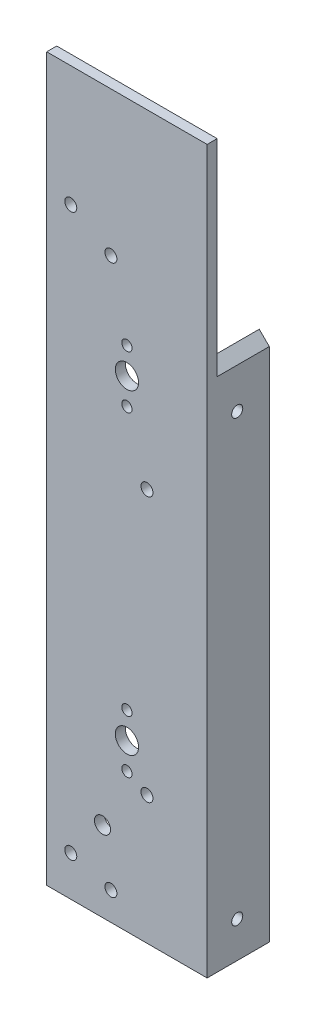
ISO-10303-21;
HEADER;
FILE_DESCRIPTION(('STEP AP214'),'2;1');
FILE_NAME('part.step','',(''),(''),'','','');
FILE_SCHEMA(('AUTOMOTIVE_DESIGN { 1 0 10303 214 1 1 1 1 }'));
ENDSEC;
DATA;
#1=APPLICATION_CONTEXT('core data for automotive mechanical design processes');
#2=APPLICATION_PROTOCOL_DEFINITION('international standard','automotive_design',2000,#1);
#3=PRODUCT_CONTEXT('',#1,'mechanical');
#4=PRODUCT('Part','Part','',(#3));
#5=PRODUCT_RELATED_PRODUCT_CATEGORY('part','',(#4));
#6=PRODUCT_DEFINITION_FORMATION('','',#4);
#7=PRODUCT_DEFINITION_CONTEXT('part definition',#1,'design');
#8=PRODUCT_DEFINITION('design','',#6,#7);
#9=PRODUCT_DEFINITION_SHAPE('','',#8);
#10=(LENGTH_UNIT() NAMED_UNIT(*) SI_UNIT(.MILLI.,.METRE.));
#11=(NAMED_UNIT(*) PLANE_ANGLE_UNIT() SI_UNIT($,.RADIAN.));
#12=(NAMED_UNIT(*) SI_UNIT($,.STERADIAN.) SOLID_ANGLE_UNIT());
#13=UNCERTAINTY_MEASURE_WITH_UNIT(LENGTH_MEASURE(1.E-05),#10,'distance_accuracy_value','');
#14=(GEOMETRIC_REPRESENTATION_CONTEXT(3) GLOBAL_UNCERTAINTY_ASSIGNED_CONTEXT((#13)) GLOBAL_UNIT_ASSIGNED_CONTEXT((#10,
#11,#12)) REPRESENTATION_CONTEXT('',''));
#15=CARTESIAN_POINT('',(0.,0.,0.));
#16=DIRECTION('',(0.,0.,1.));
#17=DIRECTION('',(1.,0.,0.));
#18=AXIS2_PLACEMENT_3D('',#15,#16,#17);
#19=CARTESIAN_POINT('',(-50.8,203.2,0.));
#20=DIRECTION('',(-1.,0.,0.));
#21=DIRECTION('',(0.,0.,1.));
#22=AXIS2_PLACEMENT_3D('',#19,#20,#21);
#23=PLANE('',#22);
#24=DIRECTION('',(0.,0.,-1.));
#25=VECTOR('',#24,1.);
#26=CARTESIAN_POINT('',(-50.8,0.,0.));
#27=LINE('',#26,#25);
#28=CARTESIAN_POINT('',(-50.8,0.,0.));
#29=VERTEX_POINT('',#28);
#30=CARTESIAN_POINT('',(-50.8,0.,-3.17499999999999));
#31=VERTEX_POINT('',#30);
#32=EDGE_CURVE('E171',#29,#31,#27,.T.);
#33=ORIENTED_EDGE('',*,*,#32,.F.);
#34=DIRECTION('',(0.,-1.,0.));
#35=VECTOR('',#34,1.);
#36=CARTESIAN_POINT('',(-50.8,203.2,0.));
#37=LINE('',#36,#35);
#38=CARTESIAN_POINT('',(-50.8,228.6,0.));
#39=VERTEX_POINT('',#38);
#40=EDGE_CURVE('E43',#39,#29,#37,.T.);
#41=ORIENTED_EDGE('',*,*,#40,.F.);
#42=DIRECTION('',(0.,0.,1.));
#43=VECTOR('',#42,1.);
#44=CARTESIAN_POINT('',(-50.8,228.6,-3.175));
#45=LINE('',#44,#43);
#46=CARTESIAN_POINT('',(-50.8,228.6,-3.175));
#47=VERTEX_POINT('',#46);
#48=EDGE_CURVE('E102',#47,#39,#45,.T.);
#49=ORIENTED_EDGE('',*,*,#48,.F.);
#50=DIRECTION('',(0.,-1.,0.));
#51=VECTOR('',#50,1.);
#52=CARTESIAN_POINT('',(-50.8,203.2,-3.17499999999999));
#53=LINE('',#52,#51);
#54=EDGE_CURVE('E113',#47,#31,#53,.T.);
#55=ORIENTED_EDGE('',*,*,#54,.T.);
#56=EDGE_LOOP('',(#33,#41,#49,#55));
#57=FACE_BOUND('',#56,.T.);
#58=ADVANCED_FACE('F35',(#57),#23,.T.);
#59=CARTESIAN_POINT('',(0.,203.2,0.));
#60=DIRECTION('',(0.,0.,1.));
#61=DIRECTION('',(1.,0.,0.));
#62=AXIS2_PLACEMENT_3D('',#59,#60,#61);
#63=PLANE('',#62);
#64=CARTESIAN_POINT('',(-25.4,60.782,0.));
#65=DIRECTION('',(0.,0.,1.));
#66=DIRECTION('',(1.,0.,0.));
#67=AXIS2_PLACEMENT_3D('',#64,#65,#66);
#68=CIRCLE('',#67,1.63195000000003);
#69=CARTESIAN_POINT('',(-23.76805,60.782,0.));
#70=VERTEX_POINT('',#69);
#71=EDGE_CURVE('E215',#70,#70,#68,.T.);
#72=ORIENTED_EDGE('',*,*,#71,.F.);
#73=EDGE_LOOP('',(#72));
#74=FACE_BOUND('',#73,.T.);
#75=CARTESIAN_POINT('',(-25.4,44.018,0.));
#76=DIRECTION('',(0.,0.,1.));
#77=DIRECTION('',(1.,0.,0.));
#78=AXIS2_PLACEMENT_3D('',#75,#76,#77);
#79=CIRCLE('',#78,1.63195000000003);
#80=CARTESIAN_POINT('',(-23.76805,44.018,0.));
#81=VERTEX_POINT('',#80);
#82=EDGE_CURVE('E218',#81,#81,#79,.T.);
#83=ORIENTED_EDGE('',*,*,#82,.F.);
#84=EDGE_LOOP('',(#83));
#85=FACE_BOUND('',#84,.T.);
#86=CARTESIAN_POINT('',(-25.4,52.4,0.));
#87=DIRECTION('',(0.,0.,1.));
#88=DIRECTION('',(1.,0.,0.));
#89=AXIS2_PLACEMENT_3D('',#86,#87,#88);
#90=CIRCLE('',#89,3.68299999999999);
#91=CARTESIAN_POINT('',(-21.717,52.4,0.));
#92=VERTEX_POINT('',#91);
#93=EDGE_CURVE('E214',#92,#92,#90,.T.);
#94=ORIENTED_EDGE('',*,*,#93,.F.);
#95=EDGE_LOOP('',(#94));
#96=FACE_BOUND('',#95,.T.);
#97=CARTESIAN_POINT('',(-43.18,190.498941663727,0.));
#98=DIRECTION('',(0.,0.,-1.));
#99=DIRECTION('',(-1.,0.,0.));
#100=AXIS2_PLACEMENT_3D('',#97,#98,#99);
#101=CIRCLE('',#100,1.89865);
#102=CARTESIAN_POINT('',(-45.07865,190.498941663727,0.));
#103=VERTEX_POINT('',#102);
#104=EDGE_CURVE('E232',#103,#103,#101,.T.);
#105=ORIENTED_EDGE('',*,*,#104,.T.);
#106=EDGE_LOOP('',(#105));
#107=FACE_BOUND('',#106,.T.);
#108=CARTESIAN_POINT('',(-43.18,12.7,0.));
#109=DIRECTION('',(0.,0.,-1.));
#110=DIRECTION('',(-1.,0.,0.));
#111=AXIS2_PLACEMENT_3D('',#108,#109,#110);
#112=CIRCLE('',#111,1.89865);
#113=CARTESIAN_POINT('',(-45.07865,12.7,0.));
#114=VERTEX_POINT('',#113);
#115=EDGE_CURVE('E238',#114,#114,#112,.T.);
#116=ORIENTED_EDGE('',*,*,#115,.T.);
#117=EDGE_LOOP('',(#116));
#118=FACE_BOUND('',#117,.T.);
#119=CARTESIAN_POINT('',(-33.1361964987955,25.4,0.));
#120=DIRECTION('',(0.,0.,1.));
#121=DIRECTION('',(1.,0.,0.));
#122=AXIS2_PLACEMENT_3D('',#119,#120,#121);
#123=CIRCLE('',#122,2.54);
#124=CARTESIAN_POINT('',(-30.5961964987955,25.4,0.));
#125=VERTEX_POINT('',#124);
#126=EDGE_CURVE('E211',#125,#125,#123,.T.);
#127=ORIENTED_EDGE('',*,*,#126,.F.);
#128=EDGE_LOOP('',(#127));
#129=FACE_BOUND('',#128,.T.);
#130=DIRECTION('',(-1.,0.,0.));
#131=VECTOR('',#130,1.);
#132=CARTESIAN_POINT('',(-50.8,228.6,0.));
#133=LINE('',#132,#131);
#134=CARTESIAN_POINT('',(0.,228.6,0.));
#135=VERTEX_POINT('',#134);
#136=EDGE_CURVE('E100',#135,#39,#133,.T.);
#137=ORIENTED_EDGE('',*,*,#136,.T.);
#138=ORIENTED_EDGE('',*,*,#40,.T.);
#139=DIRECTION('',(-1.,0.,0.));
#140=VECTOR('',#139,1.);
#141=CARTESIAN_POINT('',(0.,0.,0.));
#142=LINE('',#141,#140);
#143=CARTESIAN_POINT('',(0.,0.,0.));
#144=VERTEX_POINT('',#143);
#145=EDGE_CURVE('E186',#144,#29,#142,.T.);
#146=ORIENTED_EDGE('',*,*,#145,.F.);
#147=DIRECTION('',(0.,-1.,0.));
#148=VECTOR('',#147,1.);
#149=CARTESIAN_POINT('',(0.,203.2,0.));
#150=LINE('',#149,#148);
#151=EDGE_CURVE('E190',#135,#144,#150,.T.);
#152=ORIENTED_EDGE('',*,*,#151,.F.);
#153=EDGE_LOOP('',(#137,#138,#146,#152));
#154=FACE_BOUND('',#153,.T.);
#155=CARTESIAN_POINT('',(-19.05,124.46,0.));
#156=DIRECTION('',(0.,0.,-1.));
#157=DIRECTION('',(-1.,0.,0.));
#158=AXIS2_PLACEMENT_3D('',#155,#156,#157);
#159=CIRCLE('',#158,1.89865);
#160=CARTESIAN_POINT('',(-20.94865,124.46,0.));
#161=VERTEX_POINT('',#160);
#162=EDGE_CURVE('E122',#161,#161,#159,.T.);
#163=ORIENTED_EDGE('',*,*,#162,.T.);
#164=EDGE_LOOP('',(#163));
#165=FACE_BOUND('',#164,.T.);
#166=CARTESIAN_POINT('',(-19.05,40.64,0.));
#167=DIRECTION('',(0.,0.,-1.));
#168=DIRECTION('',(-1.,0.,0.));
#169=AXIS2_PLACEMENT_3D('',#166,#167,#168);
#170=CIRCLE('',#169,1.89865);
#171=CARTESIAN_POINT('',(-20.94865,40.64,0.));
#172=VERTEX_POINT('',#171);
#173=EDGE_CURVE('E128',#172,#172,#170,.T.);
#174=ORIENTED_EDGE('',*,*,#173,.T.);
#175=EDGE_LOOP('',(#174));
#176=FACE_BOUND('',#175,.T.);
#177=CARTESIAN_POINT('',(-30.4799999999999,182.88,0.));
#178=DIRECTION('',(0.,0.,-1.));
#179=DIRECTION('',(-1.,0.,0.));
#180=AXIS2_PLACEMENT_3D('',#177,#178,#179);
#181=CIRCLE('',#180,1.89865);
#182=CARTESIAN_POINT('',(-32.3786499999999,182.88,0.));
#183=VERTEX_POINT('',#182);
#184=EDGE_CURVE('E134',#183,#183,#181,.T.);
#185=ORIENTED_EDGE('',*,*,#184,.T.);
#186=EDGE_LOOP('',(#185));
#187=FACE_BOUND('',#186,.T.);
#188=CARTESIAN_POINT('',(-30.48,8.89,0.));
#189=DIRECTION('',(0.,0.,-1.));
#190=DIRECTION('',(-1.,0.,0.));
#191=AXIS2_PLACEMENT_3D('',#188,#189,#190);
#192=CIRCLE('',#191,1.89865);
#193=CARTESIAN_POINT('',(-32.37865,8.89,0.));
#194=VERTEX_POINT('',#193);
#195=EDGE_CURVE('E140',#194,#194,#192,.T.);
#196=ORIENTED_EDGE('',*,*,#195,.T.);
#197=EDGE_LOOP('',(#196));
#198=FACE_BOUND('',#197,.T.);
#199=CARTESIAN_POINT('',(-25.4,144.018,0.));
#200=DIRECTION('',(0.,0.,1.));
#201=DIRECTION('',(1.,0.,0.));
#202=AXIS2_PLACEMENT_3D('',#199,#200,#201);
#203=CIRCLE('',#202,1.63195000000002);
#204=CARTESIAN_POINT('',(-23.76805,144.018,0.));
#205=VERTEX_POINT('',#204);
#206=EDGE_CURVE('E153',#205,#205,#203,.T.);
#207=ORIENTED_EDGE('',*,*,#206,.F.);
#208=EDGE_LOOP('',(#207));
#209=FACE_BOUND('',#208,.T.);
#210=CARTESIAN_POINT('',(-25.4,160.782,0.));
#211=DIRECTION('',(0.,0.,1.));
#212=DIRECTION('',(1.,0.,0.));
#213=AXIS2_PLACEMENT_3D('',#210,#211,#212);
#214=CIRCLE('',#213,1.63195000000002);
#215=CARTESIAN_POINT('',(-23.76805,160.782,0.));
#216=VERTEX_POINT('',#215);
#217=EDGE_CURVE('E157',#216,#216,#214,.T.);
#218=ORIENTED_EDGE('',*,*,#217,.F.);
#219=EDGE_LOOP('',(#218));
#220=FACE_BOUND('',#219,.T.);
#221=CARTESIAN_POINT('',(-25.4,152.4,0.));
#222=DIRECTION('',(0.,0.,1.));
#223=DIRECTION('',(1.,0.,0.));
#224=AXIS2_PLACEMENT_3D('',#221,#222,#223);
#225=CIRCLE('',#224,3.68299999999999);
#226=CARTESIAN_POINT('',(-21.717,152.4,0.));
#227=VERTEX_POINT('',#226);
#228=EDGE_CURVE('E161',#227,#227,#225,.T.);
#229=ORIENTED_EDGE('',*,*,#228,.F.);
#230=EDGE_LOOP('',(#229));
#231=FACE_BOUND('',#230,.T.);
#232=ADVANCED_FACE('F247',(#74,#85,#96,#107,#118,#129,#154,#165,#176,#187,#198,#209,#220,#231),
#63,.T.);
#233=CARTESIAN_POINT('',(0.,203.2,-19.685));
#234=DIRECTION('',(1.,0.,0.));
#235=DIRECTION('',(0.,0.,-1.));
#236=AXIS2_PLACEMENT_3D('',#233,#234,#235);
#237=PLANE('',#236);
#238=CARTESIAN_POINT('',(0.,11.43,-9.53047451334044));
#239=DIRECTION('',(1.,0.,0.));
#240=DIRECTION('',(0.,0.,-1.));
#241=AXIS2_PLACEMENT_3D('',#238,#239,#240);
#242=CIRCLE('',#241,1.7526);
#243=CARTESIAN_POINT('',(0.,11.43,-11.2830745133404));
#244=VERTEX_POINT('',#243);
#245=EDGE_CURVE('E143',#244,#244,#242,.T.);
#246=ORIENTED_EDGE('',*,*,#245,.F.);
#247=EDGE_LOOP('',(#246));
#248=FACE_BOUND('',#247,.T.);
#249=CARTESIAN_POINT('',(0.,150.622,-9.53047451334044));
#250=DIRECTION('',(1.,0.,0.));
#251=DIRECTION('',(0.,0.,-1.));
#252=AXIS2_PLACEMENT_3D('',#249,#250,#251);
#253=CIRCLE('',#252,1.7526);
#254=CARTESIAN_POINT('',(0.,150.622,-11.2830745133404));
#255=VERTEX_POINT('',#254);
#256=EDGE_CURVE('E149',#255,#255,#253,.T.);
#257=ORIENTED_EDGE('',*,*,#256,.F.);
#258=EDGE_LOOP('',(#257));
#259=FACE_BOUND('',#258,.T.);
#260=DIRECTION('',(0.,0.,1.));
#261=VECTOR('',#260,1.);
#262=CARTESIAN_POINT('',(0.,163.322,-19.685));
#263=LINE('',#262,#261);
#264=CARTESIAN_POINT('',(0.,163.322,-19.685));
#265=VERTEX_POINT('',#264);
#266=CARTESIAN_POINT('',(0.,163.322,-3.175));
#267=VERTEX_POINT('',#266);
#268=EDGE_CURVE('E108',#265,#267,#263,.T.);
#269=ORIENTED_EDGE('',*,*,#268,.T.);
#270=DIRECTION('',(0.,1.,0.));
#271=VECTOR('',#270,1.);
#272=CARTESIAN_POINT('',(0.,228.6,-3.175));
#273=LINE('',#272,#271);
#274=CARTESIAN_POINT('',(0.,228.6,-3.175));
#275=VERTEX_POINT('',#274);
#276=EDGE_CURVE('E105',#267,#275,#273,.T.);
#277=ORIENTED_EDGE('',*,*,#276,.T.);
#278=DIRECTION('',(0.,0.,1.));
#279=VECTOR('',#278,1.);
#280=CARTESIAN_POINT('',(0.,228.6,-3.175));
#281=LINE('',#280,#279);
#282=EDGE_CURVE('E94',#275,#135,#281,.T.);
#283=ORIENTED_EDGE('',*,*,#282,.T.);
#284=ORIENTED_EDGE('',*,*,#151,.T.);
#285=DIRECTION('',(0.,0.,1.));
#286=VECTOR('',#285,1.);
#287=CARTESIAN_POINT('',(0.,0.,-19.685));
#288=LINE('',#287,#286);
#289=CARTESIAN_POINT('',(0.,0.,-19.685));
#290=VERTEX_POINT('',#289);
#291=EDGE_CURVE('E183',#290,#144,#288,.T.);
#292=ORIENTED_EDGE('',*,*,#291,.F.);
#293=DIRECTION('',(0.,-1.,0.));
#294=VECTOR('',#293,1.);
#295=CARTESIAN_POINT('',(0.,203.2,-19.685));
#296=LINE('',#295,#294);
#297=EDGE_CURVE('E192',#265,#290,#296,.T.);
#298=ORIENTED_EDGE('',*,*,#297,.F.);
#299=EDGE_LOOP('',(#269,#277,#283,#284,#292,#298));
#300=FACE_BOUND('',#299,.T.);
#301=ADVANCED_FACE('F106',(#248,#259,#300),#237,.T.);
#302=CARTESIAN_POINT('',(-3.17500000000001,203.2,-19.685));
#303=DIRECTION('',(0.,0.,-1.));
#304=DIRECTION('',(-1.,0.,0.));
#305=AXIS2_PLACEMENT_3D('',#302,#303,#304);
#306=PLANE('',#305);
#307=DIRECTION('',(0.707106781186549,-0.707106781186546,0.));
#308=VECTOR('',#307,1.);
#309=CARTESIAN_POINT('',(-50.8,214.122,-19.685));
#310=LINE('',#309,#308);
#311=CARTESIAN_POINT('',(-3.175,166.497,-19.685));
#312=VERTEX_POINT('',#311);
#313=EDGE_CURVE('E165',#312,#265,#310,.T.);
#314=ORIENTED_EDGE('',*,*,#313,.T.);
#315=ORIENTED_EDGE('',*,*,#297,.T.);
#316=DIRECTION('',(1.,0.,0.));
#317=VECTOR('',#316,1.);
#318=CARTESIAN_POINT('',(-3.17500000000001,0.,-19.685));
#319=LINE('',#318,#317);
#320=CARTESIAN_POINT('',(-3.17500000000001,0.,-19.685));
#321=VERTEX_POINT('',#320);
#322=EDGE_CURVE('E180',#321,#290,#319,.T.);
#323=ORIENTED_EDGE('',*,*,#322,.F.);
#324=DIRECTION('',(0.,-1.,0.));
#325=VECTOR('',#324,1.);
#326=CARTESIAN_POINT('',(-3.17500000000001,203.2,-19.685));
#327=LINE('',#326,#325);
#328=EDGE_CURVE('E194',#312,#321,#327,.T.);
#329=ORIENTED_EDGE('',*,*,#328,.F.);
#330=EDGE_LOOP('',(#314,#315,#323,#329));
#331=FACE_BOUND('',#330,.T.);
#332=ADVANCED_FACE('F292',(#331),#306,.T.);
#333=CARTESIAN_POINT('',(-3.17500000000001,203.2,-3.175));
#334=DIRECTION('',(-1.,0.,0.));
#335=DIRECTION('',(0.,0.,1.));
#336=AXIS2_PLACEMENT_3D('',#333,#334,#335);
#337=PLANE('',#336);
#338=CARTESIAN_POINT('',(-3.175,11.43,-9.53047451334043));
#339=DIRECTION('',(-1.,0.,0.));
#340=DIRECTION('',(0.,0.,1.));
#341=AXIS2_PLACEMENT_3D('',#338,#339,#340);
#342=CIRCLE('',#341,1.7526);
#343=CARTESIAN_POINT('',(-3.175,11.43,-7.77787451334043));
#344=VERTEX_POINT('',#343);
#345=EDGE_CURVE('E148',#344,#344,#342,.T.);
#346=ORIENTED_EDGE('',*,*,#345,.F.);
#347=EDGE_LOOP('',(#346));
#348=FACE_BOUND('',#347,.T.);
#349=CARTESIAN_POINT('',(-3.175,150.622,-9.53047451334043));
#350=DIRECTION('',(-1.,0.,0.));
#351=DIRECTION('',(0.,0.,1.));
#352=AXIS2_PLACEMENT_3D('',#349,#350,#351);
#353=CIRCLE('',#352,1.7526);
#354=CARTESIAN_POINT('',(-3.175,150.622,-7.77787451334044));
#355=VERTEX_POINT('',#354);
#356=EDGE_CURVE('E152',#355,#355,#353,.T.);
#357=ORIENTED_EDGE('',*,*,#356,.F.);
#358=EDGE_LOOP('',(#357));
#359=FACE_BOUND('',#358,.T.);
#360=DIRECTION('',(0.,0.,1.));
#361=VECTOR('',#360,1.);
#362=CARTESIAN_POINT('',(-3.17500000000001,166.497,-3.175));
#363=LINE('',#362,#361);
#364=CARTESIAN_POINT('',(-3.175,166.497,-3.175));
#365=VERTEX_POINT('',#364);
#366=EDGE_CURVE('E169',#312,#365,#363,.T.);
#367=ORIENTED_EDGE('',*,*,#366,.F.);
#368=ORIENTED_EDGE('',*,*,#328,.T.);
#369=DIRECTION('',(0.,0.,-1.));
#370=VECTOR('',#369,1.);
#371=CARTESIAN_POINT('',(-3.17500000000001,0.,-3.175));
#372=LINE('',#371,#370);
#373=CARTESIAN_POINT('',(-3.17500000000001,0.,-3.175));
#374=VERTEX_POINT('',#373);
#375=EDGE_CURVE('E177',#374,#321,#372,.T.);
#376=ORIENTED_EDGE('',*,*,#375,.F.);
#377=DIRECTION('',(0.,-1.,0.));
#378=VECTOR('',#377,1.);
#379=CARTESIAN_POINT('',(-3.17500000000001,203.2,-3.175));
#380=LINE('',#379,#378);
#381=EDGE_CURVE('E196',#365,#374,#380,.T.);
#382=ORIENTED_EDGE('',*,*,#381,.F.);
#383=EDGE_LOOP('',(#367,#368,#376,#382));
#384=FACE_BOUND('',#383,.T.);
#385=ADVANCED_FACE('F296',(#348,#359,#384),#337,.T.);
#386=CARTESIAN_POINT('',(-50.8,203.2,-3.17499999999999));
#387=DIRECTION('',(0.,0.,-1.));
#388=DIRECTION('',(-1.,0.,0.));
#389=AXIS2_PLACEMENT_3D('',#386,#387,#388);
#390=PLANE('',#389);
#391=CARTESIAN_POINT('',(-25.4,60.782,-3.175));
#392=DIRECTION('',(0.,0.,-1.));
#393=DIRECTION('',(-1.,0.,0.));
#394=AXIS2_PLACEMENT_3D('',#391,#392,#393);
#395=CIRCLE('',#394,1.63195000000003);
#396=CARTESIAN_POINT('',(-27.03195,60.782,-3.175));
#397=VERTEX_POINT('',#396);
#398=EDGE_CURVE('E38',#397,#397,#395,.T.);
#399=ORIENTED_EDGE('',*,*,#398,.F.);
#400=EDGE_LOOP('',(#399));
#401=FACE_BOUND('',#400,.T.);
#402=CARTESIAN_POINT('',(-25.4,44.018,-3.175));
#403=DIRECTION('',(0.,0.,-1.));
#404=DIRECTION('',(-1.,0.,0.));
#405=AXIS2_PLACEMENT_3D('',#402,#403,#404);
#406=CIRCLE('',#405,1.63195000000003);
#407=CARTESIAN_POINT('',(-27.03195,44.018,-3.175));
#408=VERTEX_POINT('',#407);
#409=EDGE_CURVE('E216',#408,#408,#406,.T.);
#410=ORIENTED_EDGE('',*,*,#409,.F.);
#411=EDGE_LOOP('',(#410));
#412=FACE_BOUND('',#411,.T.);
#413=CARTESIAN_POINT('',(-25.4,52.4,-3.175));
#414=DIRECTION('',(0.,0.,-1.));
#415=DIRECTION('',(-1.,0.,0.));
#416=AXIS2_PLACEMENT_3D('',#413,#414,#415);
#417=CIRCLE('',#416,3.68299999999999);
#418=CARTESIAN_POINT('',(-29.083,52.4,-3.175));
#419=VERTEX_POINT('',#418);
#420=EDGE_CURVE('E212',#419,#419,#417,.T.);
#421=ORIENTED_EDGE('',*,*,#420,.F.);
#422=EDGE_LOOP('',(#421));
#423=FACE_BOUND('',#422,.T.);
#424=CARTESIAN_POINT('',(-43.18,190.498941663727,-3.17499999999999));
#425=DIRECTION('',(0.,0.,-1.));
#426=DIRECTION('',(-1.,0.,0.));
#427=AXIS2_PLACEMENT_3D('',#424,#425,#426);
#428=CIRCLE('',#427,1.89865);
#429=CARTESIAN_POINT('',(-45.07865,190.498941663727,-3.17499999999999));
#430=VERTEX_POINT('',#429);
#431=EDGE_CURVE('E231',#430,#430,#428,.T.);
#432=ORIENTED_EDGE('',*,*,#431,.F.);
#433=EDGE_LOOP('',(#432));
#434=FACE_BOUND('',#433,.T.);
#435=CARTESIAN_POINT('',(-43.18,12.7,-3.17499999999999));
#436=DIRECTION('',(0.,0.,-1.));
#437=DIRECTION('',(-1.,0.,0.));
#438=AXIS2_PLACEMENT_3D('',#435,#436,#437);
#439=CIRCLE('',#438,1.89865);
#440=CARTESIAN_POINT('',(-45.07865,12.7,-3.17499999999999));
#441=VERTEX_POINT('',#440);
#442=EDGE_CURVE('E235',#441,#441,#439,.T.);
#443=ORIENTED_EDGE('',*,*,#442,.F.);
#444=EDGE_LOOP('',(#443));
#445=FACE_BOUND('',#444,.T.);
#446=CARTESIAN_POINT('',(-33.1361964987955,25.4,-3.175));
#447=DIRECTION('',(0.,0.,-1.));
#448=DIRECTION('',(-1.,0.,0.));
#449=AXIS2_PLACEMENT_3D('',#446,#447,#448);
#450=CIRCLE('',#449,2.54);
#451=CARTESIAN_POINT('',(-35.6761964987955,25.4,-3.175));
#452=VERTEX_POINT('',#451);
#453=EDGE_CURVE('E119',#452,#452,#450,.T.);
#454=ORIENTED_EDGE('',*,*,#453,.F.);
#455=EDGE_LOOP('',(#454));
#456=FACE_BOUND('',#455,.T.);
#457=CARTESIAN_POINT('',(-19.05,124.46,-3.175));
#458=DIRECTION('',(0.,0.,-1.));
#459=DIRECTION('',(-1.,0.,0.));
#460=AXIS2_PLACEMENT_3D('',#457,#458,#459);
#461=CIRCLE('',#460,1.89865);
#462=CARTESIAN_POINT('',(-20.94865,124.46,-3.175));
#463=VERTEX_POINT('',#462);
#464=EDGE_CURVE('E120',#463,#463,#461,.T.);
#465=ORIENTED_EDGE('',*,*,#464,.F.);
#466=EDGE_LOOP('',(#465));
#467=FACE_BOUND('',#466,.T.);
#468=CARTESIAN_POINT('',(-19.05,40.64,-3.175));
#469=DIRECTION('',(0.,0.,-1.));
#470=DIRECTION('',(-1.,0.,0.));
#471=AXIS2_PLACEMENT_3D('',#468,#469,#470);
#472=CIRCLE('',#471,1.89865);
#473=CARTESIAN_POINT('',(-20.94865,40.64,-3.175));
#474=VERTEX_POINT('',#473);
#475=EDGE_CURVE('E125',#474,#474,#472,.T.);
#476=ORIENTED_EDGE('',*,*,#475,.F.);
#477=EDGE_LOOP('',(#476));
#478=FACE_BOUND('',#477,.T.);
#479=CARTESIAN_POINT('',(-30.4799999999999,182.88,-3.175));
#480=DIRECTION('',(0.,0.,-1.));
#481=DIRECTION('',(-1.,0.,0.));
#482=AXIS2_PLACEMENT_3D('',#479,#480,#481);
#483=CIRCLE('',#482,1.89865);
#484=CARTESIAN_POINT('',(-32.3786499999999,182.88,-3.175));
#485=VERTEX_POINT('',#484);
#486=EDGE_CURVE('E131',#485,#485,#483,.T.);
#487=ORIENTED_EDGE('',*,*,#486,.F.);
#488=EDGE_LOOP('',(#487));
#489=FACE_BOUND('',#488,.T.);
#490=CARTESIAN_POINT('',(-30.48,8.89,-3.175));
#491=DIRECTION('',(0.,0.,-1.));
#492=DIRECTION('',(-1.,0.,0.));
#493=AXIS2_PLACEMENT_3D('',#490,#491,#492);
#494=CIRCLE('',#493,1.89865);
#495=CARTESIAN_POINT('',(-32.37865,8.89,-3.175));
#496=VERTEX_POINT('',#495);
#497=EDGE_CURVE('E137',#496,#496,#494,.T.);
#498=ORIENTED_EDGE('',*,*,#497,.F.);
#499=EDGE_LOOP('',(#498));
#500=FACE_BOUND('',#499,.T.);
#501=CARTESIAN_POINT('',(-25.4,144.018,-3.175));
#502=DIRECTION('',(0.,0.,-1.));
#503=DIRECTION('',(-1.,0.,0.));
#504=AXIS2_PLACEMENT_3D('',#501,#502,#503);
#505=CIRCLE('',#504,1.63195000000002);
#506=CARTESIAN_POINT('',(-27.03195,144.018,-3.175));
#507=VERTEX_POINT('',#506);
#508=EDGE_CURVE('E156',#507,#507,#505,.T.);
#509=ORIENTED_EDGE('',*,*,#508,.F.);
#510=EDGE_LOOP('',(#509));
#511=FACE_BOUND('',#510,.T.);
#512=CARTESIAN_POINT('',(-25.4,160.782,-3.175));
#513=DIRECTION('',(0.,0.,-1.));
#514=DIRECTION('',(-1.,0.,0.));
#515=AXIS2_PLACEMENT_3D('',#512,#513,#514);
#516=CIRCLE('',#515,1.63195000000002);
#517=CARTESIAN_POINT('',(-27.03195,160.782,-3.175));
#518=VERTEX_POINT('',#517);
#519=EDGE_CURVE('E160',#518,#518,#516,.T.);
#520=ORIENTED_EDGE('',*,*,#519,.F.);
#521=EDGE_LOOP('',(#520));
#522=FACE_BOUND('',#521,.T.);
#523=CARTESIAN_POINT('',(-25.4,152.4,-3.175));
#524=DIRECTION('',(0.,0.,-1.));
#525=DIRECTION('',(-1.,0.,0.));
#526=AXIS2_PLACEMENT_3D('',#523,#524,#525);
#527=CIRCLE('',#526,3.68299999999999);
#528=CARTESIAN_POINT('',(-29.083,152.4,-3.175));
#529=VERTEX_POINT('',#528);
#530=EDGE_CURVE('E164',#529,#529,#527,.T.);
#531=ORIENTED_EDGE('',*,*,#530,.F.);
#532=EDGE_LOOP('',(#531));
#533=FACE_BOUND('',#532,.T.);
#534=ORIENTED_EDGE('',*,*,#54,.F.);
#535=DIRECTION('',(-1.,0.,0.));
#536=VECTOR('',#535,1.);
#537=CARTESIAN_POINT('',(-50.8,228.6,-3.175));
#538=LINE('',#537,#536);
#539=EDGE_CURVE('E99',#275,#47,#538,.T.);
#540=ORIENTED_EDGE('',*,*,#539,.F.);
#541=ORIENTED_EDGE('',*,*,#276,.F.);
#542=DIRECTION('',(0.707106781186549,-0.707106781186546,0.));
#543=VECTOR('',#542,1.);
#544=CARTESIAN_POINT('',(-50.8,214.122,-3.175));
#545=LINE('',#544,#543);
#546=EDGE_CURVE('E11',#365,#267,#545,.T.);
#547=ORIENTED_EDGE('',*,*,#546,.F.);
#548=ORIENTED_EDGE('',*,*,#381,.T.);
#549=DIRECTION('',(1.,0.,0.));
#550=VECTOR('',#549,1.);
#551=CARTESIAN_POINT('',(-50.8,0.,-3.17499999999999));
#552=LINE('',#551,#550);
#553=EDGE_CURVE('E174',#31,#374,#552,.T.);
#554=ORIENTED_EDGE('',*,*,#553,.F.);
#555=EDGE_LOOP('',(#534,#540,#541,#547,#548,#554));
#556=FACE_BOUND('',#555,.T.);
#557=ADVANCED_FACE('F111',(#401,#412,#423,#434,#445,#456,#467,#478,#489,#500,#511,#522,#533,
#556),#390,.T.);
#558=CARTESIAN_POINT('',(0.,0.,0.));
#559=DIRECTION('',(0.,-1.,0.));
#560=DIRECTION('',(0.,0.,-1.));
#561=AXIS2_PLACEMENT_3D('',#558,#559,#560);
#562=PLANE('',#561);
#563=ORIENTED_EDGE('',*,*,#32,.T.);
#564=ORIENTED_EDGE('',*,*,#553,.T.);
#565=ORIENTED_EDGE('',*,*,#375,.T.);
#566=ORIENTED_EDGE('',*,*,#322,.T.);
#567=ORIENTED_EDGE('',*,*,#291,.T.);
#568=ORIENTED_EDGE('',*,*,#145,.T.);
#569=EDGE_LOOP('',(#563,#564,#565,#566,#567,#568));
#570=FACE_BOUND('',#569,.T.);
#571=ADVANCED_FACE('F279',(#570),#562,.T.);
#572=CARTESIAN_POINT('',(-50.8,214.122,-19.685));
#573=DIRECTION('',(-0.707106781186546,-0.707106781186549,0.));
#574=DIRECTION('',(0.707106781186549,-0.707106781186546,0.));
#575=AXIS2_PLACEMENT_3D('',#572,#573,#574);
#576=PLANE('',#575);
#577=ORIENTED_EDGE('',*,*,#366,.T.);
#578=ORIENTED_EDGE('',*,*,#546,.T.);
#579=ORIENTED_EDGE('',*,*,#268,.F.);
#580=ORIENTED_EDGE('',*,*,#313,.F.);
#581=EDGE_LOOP('',(#577,#578,#579,#580));
#582=FACE_BOUND('',#581,.T.);
#583=ADVANCED_FACE('F269',(#582),#576,.F.);
#584=CARTESIAN_POINT('',(-25.4,152.4,-19.685));
#585=DIRECTION('',(0.,0.,1.));
#586=DIRECTION('',(1.,0.,0.));
#587=AXIS2_PLACEMENT_3D('',#584,#585,#586);
#588=CYLINDRICAL_SURFACE('',#587,3.68299999999999);
#589=ORIENTED_EDGE('',*,*,#530,.T.);
#590=EDGE_LOOP('',(#589));
#591=FACE_BOUND('',#590,.T.);
#592=ORIENTED_EDGE('',*,*,#228,.T.);
#593=EDGE_LOOP('',(#592));
#594=FACE_BOUND('',#593,.T.);
#595=ADVANCED_FACE('F266',(#591,#594),#588,.F.);
#596=CARTESIAN_POINT('',(-25.4,160.782,-19.685));
#597=DIRECTION('',(0.,0.,1.));
#598=DIRECTION('',(1.,0.,0.));
#599=AXIS2_PLACEMENT_3D('',#596,#597,#598);
#600=CYLINDRICAL_SURFACE('',#599,1.63195000000002);
#601=ORIENTED_EDGE('',*,*,#519,.T.);
#602=EDGE_LOOP('',(#601));
#603=FACE_BOUND('',#602,.T.);
#604=ORIENTED_EDGE('',*,*,#217,.T.);
#605=EDGE_LOOP('',(#604));
#606=FACE_BOUND('',#605,.T.);
#607=ADVANCED_FACE('F268',(#603,#606),#600,.F.);
#608=CARTESIAN_POINT('',(-25.4,144.018,-19.685));
#609=DIRECTION('',(0.,0.,1.));
#610=DIRECTION('',(1.,0.,0.));
#611=AXIS2_PLACEMENT_3D('',#608,#609,#610);
#612=CYLINDRICAL_SURFACE('',#611,1.63195000000002);
#613=ORIENTED_EDGE('',*,*,#508,.T.);
#614=EDGE_LOOP('',(#613));
#615=FACE_BOUND('',#614,.T.);
#616=ORIENTED_EDGE('',*,*,#206,.T.);
#617=EDGE_LOOP('',(#616));
#618=FACE_BOUND('',#617,.T.);
#619=ADVANCED_FACE('F276',(#615,#618),#612,.F.);
#620=CARTESIAN_POINT('',(-50.8,150.622,-9.53047451334042));
#621=DIRECTION('',(1.,0.,0.));
#622=DIRECTION('',(0.,0.,-1.));
#623=AXIS2_PLACEMENT_3D('',#620,#621,#622);
#624=CYLINDRICAL_SURFACE('',#623,1.7526);
#625=ORIENTED_EDGE('',*,*,#356,.T.);
#626=EDGE_LOOP('',(#625));
#627=FACE_BOUND('',#626,.T.);
#628=ORIENTED_EDGE('',*,*,#256,.T.);
#629=EDGE_LOOP('',(#628));
#630=FACE_BOUND('',#629,.T.);
#631=ADVANCED_FACE('F422',(#627,#630),#624,.F.);
#632=CARTESIAN_POINT('',(-50.8,11.43,-9.53047451334042));
#633=DIRECTION('',(1.,0.,0.));
#634=DIRECTION('',(0.,0.,-1.));
#635=AXIS2_PLACEMENT_3D('',#632,#633,#634);
#636=CYLINDRICAL_SURFACE('',#635,1.7526);
#637=ORIENTED_EDGE('',*,*,#345,.T.);
#638=EDGE_LOOP('',(#637));
#639=FACE_BOUND('',#638,.T.);
#640=ORIENTED_EDGE('',*,*,#245,.T.);
#641=EDGE_LOOP('',(#640));
#642=FACE_BOUND('',#641,.T.);
#643=ADVANCED_FACE('F418',(#639,#642),#636,.F.);
#644=CARTESIAN_POINT('',(-30.48,8.89,0.));
#645=DIRECTION('',(0.,0.,-1.));
#646=DIRECTION('',(-1.,0.,0.));
#647=AXIS2_PLACEMENT_3D('',#644,#645,#646);
#648=CYLINDRICAL_SURFACE('',#647,1.89865);
#649=ORIENTED_EDGE('',*,*,#195,.F.);
#650=EDGE_LOOP('',(#649));
#651=FACE_BOUND('',#650,.T.);
#652=ORIENTED_EDGE('',*,*,#497,.T.);
#653=EDGE_LOOP('',(#652));
#654=FACE_BOUND('',#653,.T.);
#655=ADVANCED_FACE('F414',(#651,#654),#648,.F.);
#656=CARTESIAN_POINT('',(-30.4799999999999,182.88,0.));
#657=DIRECTION('',(0.,0.,-1.));
#658=DIRECTION('',(-1.,0.,0.));
#659=AXIS2_PLACEMENT_3D('',#656,#657,#658);
#660=CYLINDRICAL_SURFACE('',#659,1.89865);
#661=ORIENTED_EDGE('',*,*,#184,.F.);
#662=EDGE_LOOP('',(#661));
#663=FACE_BOUND('',#662,.T.);
#664=ORIENTED_EDGE('',*,*,#486,.T.);
#665=EDGE_LOOP('',(#664));
#666=FACE_BOUND('',#665,.T.);
#667=ADVANCED_FACE('F410',(#663,#666),#660,.F.);
#668=CARTESIAN_POINT('',(-19.05,40.64,0.));
#669=DIRECTION('',(0.,0.,-1.));
#670=DIRECTION('',(-1.,0.,0.));
#671=AXIS2_PLACEMENT_3D('',#668,#669,#670);
#672=CYLINDRICAL_SURFACE('',#671,1.89865);
#673=ORIENTED_EDGE('',*,*,#173,.F.);
#674=EDGE_LOOP('',(#673));
#675=FACE_BOUND('',#674,.T.);
#676=ORIENTED_EDGE('',*,*,#475,.T.);
#677=EDGE_LOOP('',(#676));
#678=FACE_BOUND('',#677,.T.);
#679=ADVANCED_FACE('F406',(#675,#678),#672,.F.);
#680=CARTESIAN_POINT('',(-19.05,124.46,0.));
#681=DIRECTION('',(0.,0.,-1.));
#682=DIRECTION('',(-1.,0.,0.));
#683=AXIS2_PLACEMENT_3D('',#680,#681,#682);
#684=CYLINDRICAL_SURFACE('',#683,1.89865);
#685=ORIENTED_EDGE('',*,*,#162,.F.);
#686=EDGE_LOOP('',(#685));
#687=FACE_BOUND('',#686,.T.);
#688=ORIENTED_EDGE('',*,*,#464,.T.);
#689=EDGE_LOOP('',(#688));
#690=FACE_BOUND('',#689,.T.);
#691=ADVANCED_FACE('F336',(#687,#690),#684,.F.);
#692=CARTESIAN_POINT('',(-50.8,228.6,-3.175));
#693=DIRECTION('',(0.,1.,0.));
#694=DIRECTION('',(0.,0.,1.));
#695=AXIS2_PLACEMENT_3D('',#692,#693,#694);
#696=PLANE('',#695);
#697=ORIENTED_EDGE('',*,*,#136,.F.);
#698=ORIENTED_EDGE('',*,*,#282,.F.);
#699=ORIENTED_EDGE('',*,*,#539,.T.);
#700=ORIENTED_EDGE('',*,*,#48,.T.);
#701=EDGE_LOOP('',(#697,#698,#699,#700));
#702=FACE_BOUND('',#701,.T.);
#703=ADVANCED_FACE('F96',(#702),#696,.T.);
#704=CARTESIAN_POINT('',(-33.1361964987955,25.4,-19.685));
#705=DIRECTION('',(0.,0.,1.));
#706=DIRECTION('',(1.,0.,0.));
#707=AXIS2_PLACEMENT_3D('',#704,#705,#706);
#708=CYLINDRICAL_SURFACE('',#707,2.54);
#709=ORIENTED_EDGE('',*,*,#453,.T.);
#710=EDGE_LOOP('',(#709));
#711=FACE_BOUND('',#710,.T.);
#712=ORIENTED_EDGE('',*,*,#126,.T.);
#713=EDGE_LOOP('',(#712));
#714=FACE_BOUND('',#713,.T.);
#715=ADVANCED_FACE('F245',(#711,#714),#708,.F.);
#716=CARTESIAN_POINT('',(-43.18,12.7,0.));
#717=DIRECTION('',(0.,0.,-1.));
#718=DIRECTION('',(-1.,0.,0.));
#719=AXIS2_PLACEMENT_3D('',#716,#717,#718);
#720=CYLINDRICAL_SURFACE('',#719,1.89865);
#721=ORIENTED_EDGE('',*,*,#115,.F.);
#722=EDGE_LOOP('',(#721));
#723=FACE_BOUND('',#722,.T.);
#724=ORIENTED_EDGE('',*,*,#442,.T.);
#725=EDGE_LOOP('',(#724));
#726=FACE_BOUND('',#725,.T.);
#727=ADVANCED_FACE('F346',(#723,#726),#720,.F.);
#728=CARTESIAN_POINT('',(-43.18,190.498941663727,0.));
#729=DIRECTION('',(0.,0.,-1.));
#730=DIRECTION('',(-1.,0.,0.));
#731=AXIS2_PLACEMENT_3D('',#728,#729,#730);
#732=CYLINDRICAL_SURFACE('',#731,1.89865);
#733=ORIENTED_EDGE('',*,*,#104,.F.);
#734=EDGE_LOOP('',(#733));
#735=FACE_BOUND('',#734,.T.);
#736=ORIENTED_EDGE('',*,*,#431,.T.);
#737=EDGE_LOOP('',(#736));
#738=FACE_BOUND('',#737,.T.);
#739=ADVANCED_FACE('F356',(#735,#738),#732,.F.);
#740=CARTESIAN_POINT('',(-25.4,52.4,-19.685));
#741=DIRECTION('',(0.,0.,1.));
#742=DIRECTION('',(1.,0.,0.));
#743=AXIS2_PLACEMENT_3D('',#740,#741,#742);
#744=CYLINDRICAL_SURFACE('',#743,3.68299999999999);
#745=ORIENTED_EDGE('',*,*,#93,.T.);
#746=EDGE_LOOP('',(#745));
#747=FACE_BOUND('',#746,.T.);
#748=ORIENTED_EDGE('',*,*,#420,.T.);
#749=EDGE_LOOP('',(#748));
#750=FACE_BOUND('',#749,.T.);
#751=ADVANCED_FACE('F365',(#747,#750),#744,.F.);
#752=CARTESIAN_POINT('',(-25.4,44.018,-19.685));
#753=DIRECTION('',(0.,0.,1.));
#754=DIRECTION('',(1.,0.,0.));
#755=AXIS2_PLACEMENT_3D('',#752,#753,#754);
#756=CYLINDRICAL_SURFACE('',#755,1.63195000000003);
#757=ORIENTED_EDGE('',*,*,#82,.T.);
#758=EDGE_LOOP('',(#757));
#759=FACE_BOUND('',#758,.T.);
#760=ORIENTED_EDGE('',*,*,#409,.T.);
#761=EDGE_LOOP('',(#760));
#762=FACE_BOUND('',#761,.T.);
#763=ADVANCED_FACE('F380',(#759,#762),#756,.F.);
#764=CARTESIAN_POINT('',(-25.4,60.782,-19.685));
#765=DIRECTION('',(0.,0.,1.));
#766=DIRECTION('',(1.,0.,0.));
#767=AXIS2_PLACEMENT_3D('',#764,#765,#766);
#768=CYLINDRICAL_SURFACE('',#767,1.63195000000003);
#769=ORIENTED_EDGE('',*,*,#71,.T.);
#770=EDGE_LOOP('',(#769));
#771=FACE_BOUND('',#770,.T.);
#772=ORIENTED_EDGE('',*,*,#398,.T.);
#773=EDGE_LOOP('',(#772));
#774=FACE_BOUND('',#773,.T.);
#775=ADVANCED_FACE('F390',(#771,#774),#768,.F.);
#776=CLOSED_SHELL('',(#58,#232,#301,#332,#385,#557,#571,#583,#595,#607,#619,#631,#643,#655,#667,
#679,#691,#703,#715,#727,#739,#751,#763,#775));
#777=MANIFOLD_SOLID_BREP('B2',#776);
#778=ADVANCED_BREP_SHAPE_REPRESENTATION('',(#18,#777),#14);
#779=SHAPE_DEFINITION_REPRESENTATION(#9,#778);
ENDSEC;
END-ISO-10303-21;
